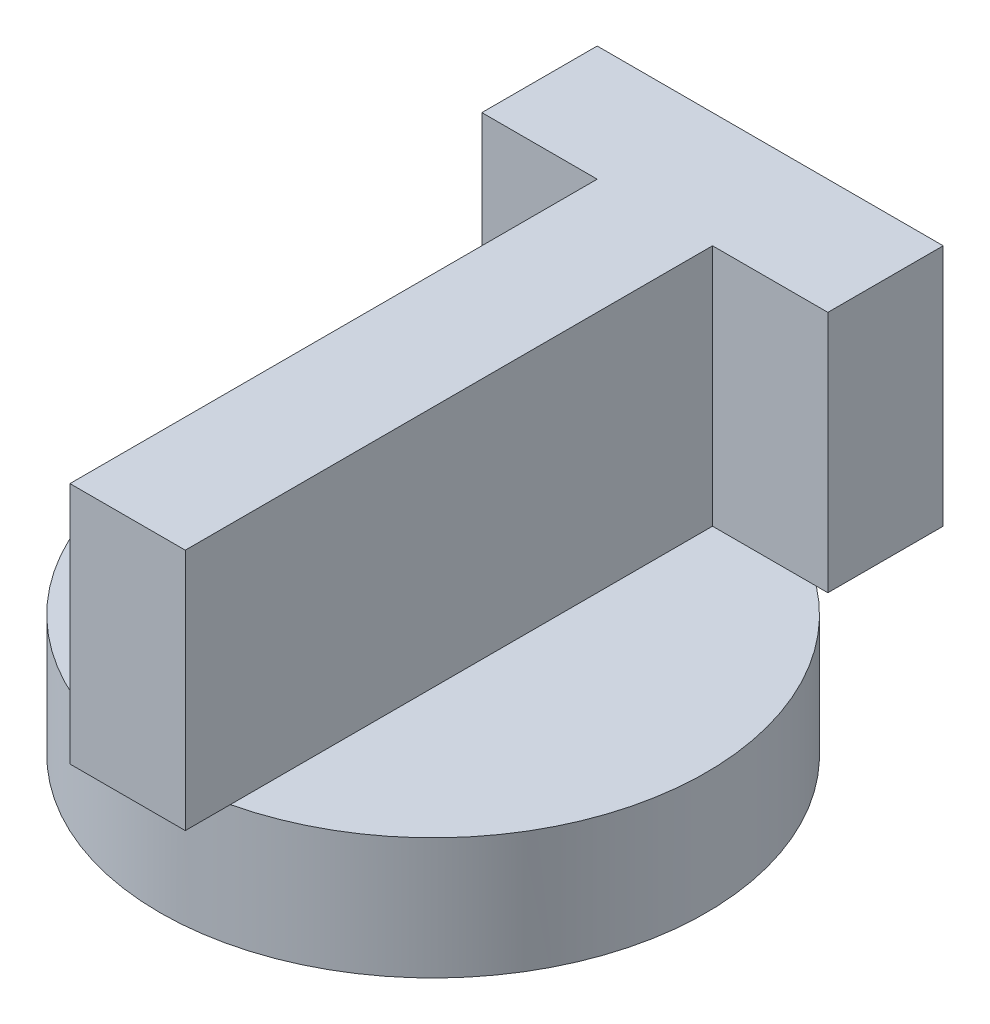
ISO-10303-21;
HEADER;
FILE_DESCRIPTION(('STEP AP214'),'2;1');
FILE_NAME('part.step','',(''),(''),'','','');
FILE_SCHEMA(('AUTOMOTIVE_DESIGN { 1 0 10303 214 1 1 1 1 }'));
ENDSEC;
DATA;
#1=APPLICATION_CONTEXT('core data for automotive mechanical design processes');
#2=APPLICATION_PROTOCOL_DEFINITION('international standard','automotive_design',2000,#1);
#3=PRODUCT_CONTEXT('',#1,'mechanical');
#4=PRODUCT('Part','Part','',(#3));
#5=PRODUCT_RELATED_PRODUCT_CATEGORY('part','',(#4));
#6=PRODUCT_DEFINITION_FORMATION('','',#4);
#7=PRODUCT_DEFINITION_CONTEXT('part definition',#1,'design');
#8=PRODUCT_DEFINITION('design','',#6,#7);
#9=PRODUCT_DEFINITION_SHAPE('','',#8);
#10=(LENGTH_UNIT() NAMED_UNIT(*) SI_UNIT(.MILLI.,.METRE.));
#11=(NAMED_UNIT(*) PLANE_ANGLE_UNIT() SI_UNIT($,.RADIAN.));
#12=(NAMED_UNIT(*) SI_UNIT($,.STERADIAN.) SOLID_ANGLE_UNIT());
#13=UNCERTAINTY_MEASURE_WITH_UNIT(LENGTH_MEASURE(1.E-05),#10,'distance_accuracy_value','');
#14=(GEOMETRIC_REPRESENTATION_CONTEXT(3) GLOBAL_UNCERTAINTY_ASSIGNED_CONTEXT((#13)) GLOBAL_UNIT_ASSIGNED_CONTEXT((#10,
#11,#12)) REPRESENTATION_CONTEXT('',''));
#15=CARTESIAN_POINT('',(0.,0.,0.));
#16=DIRECTION('',(0.,0.,1.));
#17=DIRECTION('',(1.,0.,0.));
#18=AXIS2_PLACEMENT_3D('',#15,#16,#17);
#19=CARTESIAN_POINT('',(0.,10.,0.));
#20=DIRECTION('',(0.,1.,0.));
#21=DIRECTION('',(0.,0.,1.));
#22=AXIS2_PLACEMENT_3D('',#19,#20,#21);
#23=PLANE('',#22);
#24=CARTESIAN_POINT('',(0.,10.,0.));
#25=DIRECTION('',(0.,1.,0.));
#26=DIRECTION('',(0.,0.,1.));
#27=AXIS2_PLACEMENT_3D('',#24,#25,#26);
#28=CIRCLE('',#27,22.5);
#29=CARTESIAN_POINT('',(5.18957559133582,10.,21.8933392880531));
#30=VERTEX_POINT('',#29);
#31=CARTESIAN_POINT('',(13.7379591400478,10.,-17.8190481975435));
#32=VERTEX_POINT('',#31);
#33=EDGE_CURVE('E249',#30,#32,#28,.T.);
#34=ORIENTED_EDGE('',*,*,#33,.T.);
#35=DIRECTION('',(-1.,0.,0.));
#36=VECTOR('',#35,1.);
#37=CARTESIAN_POINT('',(14.6874388391991,10.,-17.8190481975435));
#38=LINE('',#37,#36);
#39=CARTESIAN_POINT('',(5.18957559133582,10.,-17.8190481975435));
#40=VERTEX_POINT('',#39);
#41=EDGE_CURVE('E11',#32,#40,#38,.T.);
#42=ORIENTED_EDGE('',*,*,#41,.T.);
#43=DIRECTION('',(0.,0.,1.));
#44=VECTOR('',#43,1.);
#45=CARTESIAN_POINT('',(5.18957559133582,10.,-17.8190481975435));
#46=LINE('',#45,#44);
#47=EDGE_CURVE('E223',#40,#30,#46,.T.);
#48=ORIENTED_EDGE('',*,*,#47,.T.);
#49=EDGE_LOOP('',(#34,#42,#48));
#50=FACE_BOUND('',#49,.T.);
#51=ADVANCED_FACE('F43',(#50),#23,.T.);
#52=CARTESIAN_POINT('',(-13.7379591400478,10.,-17.8190481975435));
#53=VERTEX_POINT('',#52);
#54=CARTESIAN_POINT('',(-4.30828765652743,10.,22.083674002951));
#55=VERTEX_POINT('',#54);
#56=EDGE_CURVE('E256',#53,#55,#28,.T.);
#57=ORIENTED_EDGE('',*,*,#56,.T.);
#58=DIRECTION('',(0.,0.,-1.));
#59=VECTOR('',#58,1.);
#60=CARTESIAN_POINT('',(-4.30828765652743,10.,25.59975522126));
#61=LINE('',#60,#59);
#62=CARTESIAN_POINT('',(-4.30828765652743,10.,-17.8190481975435));
#63=VERTEX_POINT('',#62);
#64=EDGE_CURVE('E52',#55,#63,#61,.T.);
#65=ORIENTED_EDGE('',*,*,#64,.T.);
#66=DIRECTION('',(-1.,0.,0.));
#67=VECTOR('',#66,1.);
#68=CARTESIAN_POINT('',(-4.30828765652743,10.,-17.8190481975435));
#69=LINE('',#68,#67);
#70=EDGE_CURVE('E191',#63,#53,#69,.T.);
#71=ORIENTED_EDGE('',*,*,#70,.T.);
#72=EDGE_LOOP('',(#57,#65,#71));
#73=FACE_BOUND('',#72,.T.);
#74=ADVANCED_FACE('F279',(#73),#23,.T.);
#75=CARTESIAN_POINT('',(0.,10.,0.));
#76=DIRECTION('',(0.,-1.,0.));
#77=DIRECTION('',(0.,0.,-1.));
#78=AXIS2_PLACEMENT_3D('',#75,#76,#77);
#79=CYLINDRICAL_SURFACE('',#78,22.5);
#80=ORIENTED_EDGE('',*,*,#33,.F.);
#81=EDGE_CURVE('E252',#55,#30,#28,.T.);
#82=ORIENTED_EDGE('',*,*,#81,.F.);
#83=ORIENTED_EDGE('',*,*,#56,.F.);
#84=EDGE_CURVE('E251',#32,#53,#28,.T.);
#85=ORIENTED_EDGE('',*,*,#84,.F.);
#86=EDGE_LOOP('',(#80,#82,#83,#85));
#87=FACE_BOUND('',#86,.T.);
#88=CARTESIAN_POINT('',(0.,0.,0.));
#89=DIRECTION('',(0.,1.,0.));
#90=DIRECTION('',(0.,0.,1.));
#91=AXIS2_PLACEMENT_3D('',#88,#89,#90);
#92=CIRCLE('',#91,22.5);
#93=CARTESIAN_POINT('',(0.,0.,22.5));
#94=VERTEX_POINT('',#93);
#95=EDGE_CURVE('E47',#94,#94,#92,.T.);
#96=ORIENTED_EDGE('',*,*,#95,.T.);
#97=EDGE_LOOP('',(#96));
#98=FACE_BOUND('',#97,.T.);
#99=ADVANCED_FACE('F45',(#87,#98),#79,.T.);
#100=CARTESIAN_POINT('',(0.,0.,0.));
#101=DIRECTION('',(0.,1.,0.));
#102=DIRECTION('',(0.,0.,1.));
#103=AXIS2_PLACEMENT_3D('',#100,#101,#102);
#104=PLANE('',#103);
#105=CARTESIAN_POINT('',(0.,0.,0.));
#106=DIRECTION('',(0.,-1.,0.));
#107=DIRECTION('',(0.,0.,-1.));
#108=AXIS2_PLACEMENT_3D('',#105,#106,#107);
#109=CIRCLE('',#108,21.5);
#110=CARTESIAN_POINT('',(4.83856503950974,0.,20.9484674465326));
#111=VERTEX_POINT('',#110);
#112=CARTESIAN_POINT('',(-4.83856503950294,0.,20.9484674465341));
#113=VERTEX_POINT('',#112);
#114=EDGE_CURVE('E177',#111,#113,#109,.T.);
#115=ORIENTED_EDGE('',*,*,#114,.F.);
#116=DIRECTION('',(-0.471428571428459,0.,0.881904247660097));
#117=VECTOR('',#116,1.);
#118=CARTESIAN_POINT('',(12.4726457883362,0.,6.66734693877418));
#119=LINE('',#118,#117);
#120=CARTESIAN_POINT('',(14.5514200863916,0.,2.77857142856957));
#121=VERTEX_POINT('',#120);
#122=EDGE_CURVE('E61',#121,#111,#119,.T.);
#123=ORIENTED_EDGE('',*,*,#122,.F.);
#124=CARTESIAN_POINT('',(0.,0.,-5.));
#125=DIRECTION('',(0.,-1.,0.));
#126=DIRECTION('',(0.,0.,-1.));
#127=AXIS2_PLACEMENT_3D('',#124,#125,#126);
#128=CIRCLE('',#127,16.5);
#129=CARTESIAN_POINT('',(-14.5514200863896,0.,2.77857142857328));
#130=VERTEX_POINT('',#129);
#131=EDGE_CURVE('E168',#130,#121,#128,.T.);
#132=ORIENTED_EDGE('',*,*,#131,.F.);
#133=DIRECTION('',(-0.471428571428684,0.,-0.881904247659977));
#134=VECTOR('',#133,1.);
#135=CARTESIAN_POINT('',(-12.4726457883335,0.,6.66734693877684));
#136=LINE('',#135,#134);
#137=EDGE_CURVE('E171',#113,#130,#136,.T.);
#138=ORIENTED_EDGE('',*,*,#137,.F.);
#139=EDGE_LOOP('',(#115,#123,#132,#138));
#140=FACE_BOUND('',#139,.T.);
#141=ORIENTED_EDGE('',*,*,#95,.F.);
#142=EDGE_LOOP('',(#141));
#143=FACE_BOUND('',#142,.T.);
#144=ADVANCED_FACE('F265',(#140,#143),#104,.F.);
#145=CARTESIAN_POINT('',(0.,10.,0.));
#146=DIRECTION('',(0.,-1.,0.));
#147=DIRECTION('',(0.,0.,-1.));
#148=AXIS2_PLACEMENT_3D('',#145,#146,#147);
#149=PLANE('',#148);
#150=CARTESIAN_POINT('',(14.6874388391991,10.,-17.8190481975435));
#151=VERTEX_POINT('',#150);
#152=EDGE_CURVE('E54',#151,#32,#38,.T.);
#153=ORIENTED_EDGE('',*,*,#152,.T.);
#154=ORIENTED_EDGE('',*,*,#84,.T.);
#155=CARTESIAN_POINT('',(-13.8061509043907,10.,-17.8190481975435));
#156=VERTEX_POINT('',#155);
#157=EDGE_CURVE('E69',#53,#156,#69,.T.);
#158=ORIENTED_EDGE('',*,*,#157,.T.);
#159=DIRECTION('',(0.,0.,-1.));
#160=VECTOR('',#159,1.);
#161=CARTESIAN_POINT('',(-13.8061509043907,10.,-17.8190481975435));
#162=LINE('',#161,#160);
#163=CARTESIAN_POINT('',(-13.8061509043907,10.,-27.3169114454067));
#164=VERTEX_POINT('',#163);
#165=EDGE_CURVE('E183',#156,#164,#162,.T.);
#166=ORIENTED_EDGE('',*,*,#165,.T.);
#167=DIRECTION('',(1.,0.,0.));
#168=VECTOR('',#167,1.);
#169=CARTESIAN_POINT('',(-13.8061509043907,10.,-27.3169114454067));
#170=LINE('',#169,#168);
#171=CARTESIAN_POINT('',(14.6874388391991,10.,-27.3169114454067));
#172=VERTEX_POINT('',#171);
#173=EDGE_CURVE('E215',#164,#172,#170,.T.);
#174=ORIENTED_EDGE('',*,*,#173,.T.);
#175=DIRECTION('',(0.,0.,1.));
#176=VECTOR('',#175,1.);
#177=CARTESIAN_POINT('',(14.6874388391991,10.,-27.3169114454067));
#178=LINE('',#177,#176);
#179=EDGE_CURVE('E218',#172,#151,#178,.T.);
#180=ORIENTED_EDGE('',*,*,#179,.T.);
#181=EDGE_LOOP('',(#153,#154,#158,#166,#174,#180));
#182=FACE_BOUND('',#181,.T.);
#183=ADVANCED_FACE('F267',(#182),#149,.T.);
#184=CARTESIAN_POINT('',(-13.8061509043907,30.,-17.8190481975435));
#185=DIRECTION('',(-1.,0.,0.));
#186=DIRECTION('',(0.,0.,1.));
#187=AXIS2_PLACEMENT_3D('',#184,#185,#186);
#188=PLANE('',#187);
#189=ORIENTED_EDGE('',*,*,#165,.F.);
#190=DIRECTION('',(0.,-1.,0.));
#191=VECTOR('',#190,1.);
#192=CARTESIAN_POINT('',(-13.8061509043907,30.,-17.8190481975435));
#193=LINE('',#192,#191);
#194=CARTESIAN_POINT('',(-13.8061509043907,30.,-17.8190481975435));
#195=VERTEX_POINT('',#194);
#196=EDGE_CURVE('E234',#195,#156,#193,.T.);
#197=ORIENTED_EDGE('',*,*,#196,.F.);
#198=DIRECTION('',(0.,0.,-1.));
#199=VECTOR('',#198,1.);
#200=CARTESIAN_POINT('',(-13.8061509043907,30.,-17.8190481975435));
#201=LINE('',#200,#199);
#202=CARTESIAN_POINT('',(-13.8061509043907,30.,-27.3169114454067));
#203=VERTEX_POINT('',#202);
#204=EDGE_CURVE('E187',#195,#203,#201,.T.);
#205=ORIENTED_EDGE('',*,*,#204,.T.);
#206=DIRECTION('',(0.,-1.,0.));
#207=VECTOR('',#206,1.);
#208=CARTESIAN_POINT('',(-13.8061509043907,30.,-27.3169114454067));
#209=LINE('',#208,#207);
#210=EDGE_CURVE('E212',#203,#164,#209,.T.);
#211=ORIENTED_EDGE('',*,*,#210,.T.);
#212=EDGE_LOOP('',(#189,#197,#205,#211));
#213=FACE_BOUND('',#212,.T.);
#214=ADVANCED_FACE('F274',(#213),#188,.T.);
#215=CARTESIAN_POINT('',(-4.30828765652743,30.,-17.8190481975435));
#216=DIRECTION('',(0.,0.,1.));
#217=DIRECTION('',(1.,0.,0.));
#218=AXIS2_PLACEMENT_3D('',#215,#216,#217);
#219=PLANE('',#218);
#220=ORIENTED_EDGE('',*,*,#70,.F.);
#221=DIRECTION('',(0.,-1.,0.));
#222=VECTOR('',#221,1.);
#223=CARTESIAN_POINT('',(-4.30828765652743,30.,-17.8190481975435));
#224=LINE('',#223,#222);
#225=CARTESIAN_POINT('',(-4.30828765652743,30.,-17.8190481975435));
#226=VERTEX_POINT('',#225);
#227=EDGE_CURVE('E236',#226,#63,#224,.T.);
#228=ORIENTED_EDGE('',*,*,#227,.F.);
#229=DIRECTION('',(-1.,0.,0.));
#230=VECTOR('',#229,1.);
#231=CARTESIAN_POINT('',(-4.30828765652743,30.,-17.8190481975435));
#232=LINE('',#231,#230);
#233=EDGE_CURVE('E209',#226,#195,#232,.T.);
#234=ORIENTED_EDGE('',*,*,#233,.T.);
#235=ORIENTED_EDGE('',*,*,#196,.T.);
#236=ORIENTED_EDGE('',*,*,#157,.F.);
#237=EDGE_LOOP('',(#220,#228,#234,#235,#236));
#238=FACE_BOUND('',#237,.T.);
#239=ADVANCED_FACE('F290',(#238),#219,.T.);
#240=CARTESIAN_POINT('',(-4.30828765652743,30.,25.59975522126));
#241=DIRECTION('',(-1.,0.,0.));
#242=DIRECTION('',(0.,0.,1.));
#243=AXIS2_PLACEMENT_3D('',#240,#241,#242);
#244=PLANE('',#243);
#245=CARTESIAN_POINT('',(-4.30828765652743,10.,25.59975522126));
#246=VERTEX_POINT('',#245);
#247=EDGE_CURVE('E229',#246,#55,#61,.T.);
#248=ORIENTED_EDGE('',*,*,#247,.F.);
#249=DIRECTION('',(0.,-1.,0.));
#250=VECTOR('',#249,1.);
#251=CARTESIAN_POINT('',(-4.30828765652743,30.,25.59975522126));
#252=LINE('',#251,#250);
#253=CARTESIAN_POINT('',(-4.30828765652743,30.,25.59975522126));
#254=VERTEX_POINT('',#253);
#255=EDGE_CURVE('E238',#254,#246,#252,.T.);
#256=ORIENTED_EDGE('',*,*,#255,.F.);
#257=DIRECTION('',(0.,0.,-1.));
#258=VECTOR('',#257,1.);
#259=CARTESIAN_POINT('',(-4.30828765652743,30.,25.59975522126));
#260=LINE('',#259,#258);
#261=EDGE_CURVE('E206',#254,#226,#260,.T.);
#262=ORIENTED_EDGE('',*,*,#261,.T.);
#263=ORIENTED_EDGE('',*,*,#227,.T.);
#264=ORIENTED_EDGE('',*,*,#64,.F.);
#265=EDGE_LOOP('',(#248,#256,#262,#263,#264));
#266=FACE_BOUND('',#265,.T.);
#267=ADVANCED_FACE('F312',(#266),#244,.T.);
#268=CARTESIAN_POINT('',(5.18957559133582,30.,25.59975522126));
#269=DIRECTION('',(0.,0.,1.));
#270=DIRECTION('',(1.,0.,0.));
#271=AXIS2_PLACEMENT_3D('',#268,#269,#270);
#272=PLANE('',#271);
#273=DIRECTION('',(-1.,0.,0.));
#274=VECTOR('',#273,1.);
#275=CARTESIAN_POINT('',(5.18957559133582,10.,25.59975522126));
#276=LINE('',#275,#274);
#277=CARTESIAN_POINT('',(5.18957559133582,10.,25.59975522126));
#278=VERTEX_POINT('',#277);
#279=EDGE_CURVE('E226',#278,#246,#276,.T.);
#280=ORIENTED_EDGE('',*,*,#279,.F.);
#281=DIRECTION('',(0.,-1.,0.));
#282=VECTOR('',#281,1.);
#283=CARTESIAN_POINT('',(5.18957559133582,30.,25.59975522126));
#284=LINE('',#283,#282);
#285=CARTESIAN_POINT('',(5.18957559133582,30.,25.59975522126));
#286=VERTEX_POINT('',#285);
#287=EDGE_CURVE('E240',#286,#278,#284,.T.);
#288=ORIENTED_EDGE('',*,*,#287,.F.);
#289=DIRECTION('',(-1.,0.,0.));
#290=VECTOR('',#289,1.);
#291=CARTESIAN_POINT('',(5.18957559133582,30.,25.59975522126));
#292=LINE('',#291,#290);
#293=EDGE_CURVE('E203',#286,#254,#292,.T.);
#294=ORIENTED_EDGE('',*,*,#293,.T.);
#295=ORIENTED_EDGE('',*,*,#255,.T.);
#296=EDGE_LOOP('',(#280,#288,#294,#295));
#297=FACE_BOUND('',#296,.T.);
#298=ADVANCED_FACE('F308',(#297),#272,.T.);
#299=CARTESIAN_POINT('',(5.18957559133582,30.,-17.8190481975435));
#300=DIRECTION('',(1.,0.,0.));
#301=DIRECTION('',(0.,0.,-1.));
#302=AXIS2_PLACEMENT_3D('',#299,#300,#301);
#303=PLANE('',#302);
#304=ORIENTED_EDGE('',*,*,#47,.F.);
#305=DIRECTION('',(0.,-1.,0.));
#306=VECTOR('',#305,1.);
#307=CARTESIAN_POINT('',(5.18957559133582,30.,-17.8190481975435));
#308=LINE('',#307,#306);
#309=CARTESIAN_POINT('',(5.18957559133582,30.,-17.8190481975435));
#310=VERTEX_POINT('',#309);
#311=EDGE_CURVE('E243',#310,#40,#308,.T.);
#312=ORIENTED_EDGE('',*,*,#311,.F.);
#313=DIRECTION('',(0.,0.,1.));
#314=VECTOR('',#313,1.);
#315=CARTESIAN_POINT('',(5.18957559133582,30.,-17.8190481975435));
#316=LINE('',#315,#314);
#317=EDGE_CURVE('E200',#310,#286,#316,.T.);
#318=ORIENTED_EDGE('',*,*,#317,.T.);
#319=ORIENTED_EDGE('',*,*,#287,.T.);
#320=EDGE_CURVE('E222',#30,#278,#46,.T.);
#321=ORIENTED_EDGE('',*,*,#320,.F.);
#322=EDGE_LOOP('',(#304,#312,#318,#319,#321));
#323=FACE_BOUND('',#322,.T.);
#324=ADVANCED_FACE('F304',(#323),#303,.T.);
#325=CARTESIAN_POINT('',(14.6874388391991,30.,-17.8190481975435));
#326=DIRECTION('',(0.,0.,1.));
#327=DIRECTION('',(1.,0.,0.));
#328=AXIS2_PLACEMENT_3D('',#325,#326,#327);
#329=PLANE('',#328);
#330=ORIENTED_EDGE('',*,*,#152,.F.);
#331=DIRECTION('',(0.,-1.,0.));
#332=VECTOR('',#331,1.);
#333=CARTESIAN_POINT('',(14.6874388391991,30.,-17.8190481975435));
#334=LINE('',#333,#332);
#335=CARTESIAN_POINT('',(14.6874388391991,30.,-17.8190481975435));
#336=VERTEX_POINT('',#335);
#337=EDGE_CURVE('E245',#336,#151,#334,.T.);
#338=ORIENTED_EDGE('',*,*,#337,.F.);
#339=DIRECTION('',(-1.,0.,0.));
#340=VECTOR('',#339,1.);
#341=CARTESIAN_POINT('',(14.6874388391991,30.,-17.8190481975435));
#342=LINE('',#341,#340);
#343=EDGE_CURVE('E197',#336,#310,#342,.T.);
#344=ORIENTED_EDGE('',*,*,#343,.T.);
#345=ORIENTED_EDGE('',*,*,#311,.T.);
#346=ORIENTED_EDGE('',*,*,#41,.F.);
#347=EDGE_LOOP('',(#330,#338,#344,#345,#346));
#348=FACE_BOUND('',#347,.T.);
#349=ADVANCED_FACE('F300',(#348),#329,.T.);
#350=CARTESIAN_POINT('',(14.6874388391991,30.,-27.3169114454067));
#351=DIRECTION('',(1.,0.,0.));
#352=DIRECTION('',(0.,0.,-1.));
#353=AXIS2_PLACEMENT_3D('',#350,#351,#352);
#354=PLANE('',#353);
#355=ORIENTED_EDGE('',*,*,#179,.F.);
#356=DIRECTION('',(0.,-1.,0.));
#357=VECTOR('',#356,1.);
#358=CARTESIAN_POINT('',(14.6874388391991,30.,-27.3169114454067));
#359=LINE('',#358,#357);
#360=CARTESIAN_POINT('',(14.6874388391991,30.,-27.3169114454067));
#361=VERTEX_POINT('',#360);
#362=EDGE_CURVE('E247',#361,#172,#359,.T.);
#363=ORIENTED_EDGE('',*,*,#362,.F.);
#364=DIRECTION('',(0.,0.,1.));
#365=VECTOR('',#364,1.);
#366=CARTESIAN_POINT('',(14.6874388391991,30.,-27.3169114454067));
#367=LINE('',#366,#365);
#368=EDGE_CURVE('E194',#361,#336,#367,.T.);
#369=ORIENTED_EDGE('',*,*,#368,.T.);
#370=ORIENTED_EDGE('',*,*,#337,.T.);
#371=EDGE_LOOP('',(#355,#363,#369,#370));
#372=FACE_BOUND('',#371,.T.);
#373=ADVANCED_FACE('F296',(#372),#354,.T.);
#374=CARTESIAN_POINT('',(-13.8061509043907,30.,-27.3169114454067));
#375=DIRECTION('',(0.,0.,-1.));
#376=DIRECTION('',(-1.,0.,0.));
#377=AXIS2_PLACEMENT_3D('',#374,#375,#376);
#378=PLANE('',#377);
#379=ORIENTED_EDGE('',*,*,#173,.F.);
#380=ORIENTED_EDGE('',*,*,#210,.F.);
#381=DIRECTION('',(1.,0.,0.));
#382=VECTOR('',#381,1.);
#383=CARTESIAN_POINT('',(-13.8061509043907,30.,-27.3169114454067));
#384=LINE('',#383,#382);
#385=EDGE_CURVE('E190',#203,#361,#384,.T.);
#386=ORIENTED_EDGE('',*,*,#385,.T.);
#387=ORIENTED_EDGE('',*,*,#362,.T.);
#388=EDGE_LOOP('',(#379,#380,#386,#387));
#389=FACE_BOUND('',#388,.T.);
#390=ADVANCED_FACE('F292',(#389),#378,.T.);
#391=CARTESIAN_POINT('',(0.,30.,0.));
#392=DIRECTION('',(0.,-1.,0.));
#393=DIRECTION('',(0.,0.,-1.));
#394=AXIS2_PLACEMENT_3D('',#391,#392,#393);
#395=PLANE('',#394);
#396=ORIENTED_EDGE('',*,*,#204,.F.);
#397=ORIENTED_EDGE('',*,*,#233,.F.);
#398=ORIENTED_EDGE('',*,*,#261,.F.);
#399=ORIENTED_EDGE('',*,*,#293,.F.);
#400=ORIENTED_EDGE('',*,*,#317,.F.);
#401=ORIENTED_EDGE('',*,*,#343,.F.);
#402=ORIENTED_EDGE('',*,*,#368,.F.);
#403=ORIENTED_EDGE('',*,*,#385,.F.);
#404=EDGE_LOOP('',(#396,#397,#398,#399,#400,#401,#402,#403));
#405=FACE_BOUND('',#404,.T.);
#406=ADVANCED_FACE('F295',(#405),#395,.F.);
#407=ORIENTED_EDGE('',*,*,#247,.T.);
#408=ORIENTED_EDGE('',*,*,#81,.T.);
#409=ORIENTED_EDGE('',*,*,#320,.T.);
#410=ORIENTED_EDGE('',*,*,#279,.T.);
#411=EDGE_LOOP('',(#407,#408,#409,#410));
#412=FACE_BOUND('',#411,.T.);
#413=ADVANCED_FACE('F277',(#412),#149,.T.);
#414=CARTESIAN_POINT('',(12.4726457883362,5.,6.66734693877418));
#415=DIRECTION('',(0.881904247660097,0.,0.471428571428459));
#416=DIRECTION('',(0.471428571428459,0.,-0.881904247660097));
#417=AXIS2_PLACEMENT_3D('',#414,#415,#416);
#418=PLANE('',#417);
#419=ORIENTED_EDGE('',*,*,#122,.T.);
#420=DIRECTION('',(0.,-1.,0.));
#421=VECTOR('',#420,1.);
#422=CARTESIAN_POINT('',(4.83856503950974,5.,20.9484674465326));
#423=LINE('',#422,#421);
#424=CARTESIAN_POINT('',(4.83856503950974,5.,20.9484674465326));
#425=VERTEX_POINT('',#424);
#426=EDGE_CURVE('E146',#425,#111,#423,.T.);
#427=ORIENTED_EDGE('',*,*,#426,.F.);
#428=DIRECTION('',(-0.471428571428459,0.,0.881904247660097));
#429=VECTOR('',#428,1.);
#430=CARTESIAN_POINT('',(12.4726457883362,5.,6.66734693877418));
#431=LINE('',#430,#429);
#432=CARTESIAN_POINT('',(14.5514200863916,5.,2.77857142856957));
#433=VERTEX_POINT('',#432);
#434=EDGE_CURVE('E150',#433,#425,#431,.T.);
#435=ORIENTED_EDGE('',*,*,#434,.F.);
#436=DIRECTION('',(0.,-1.,0.));
#437=VECTOR('',#436,1.);
#438=CARTESIAN_POINT('',(14.5514200863916,5.,2.77857142856957));
#439=LINE('',#438,#437);
#440=EDGE_CURVE('E181',#433,#121,#439,.T.);
#441=ORIENTED_EDGE('',*,*,#440,.T.);
#442=EDGE_LOOP('',(#419,#427,#435,#441));
#443=FACE_BOUND('',#442,.T.);
#444=ADVANCED_FACE('F148',(#443),#418,.F.);
#445=CARTESIAN_POINT('',(0.,5.,-5.));
#446=DIRECTION('',(0.,-1.,0.));
#447=DIRECTION('',(0.,0.,-1.));
#448=AXIS2_PLACEMENT_3D('',#445,#446,#447);
#449=CYLINDRICAL_SURFACE('',#448,16.5);
#450=ORIENTED_EDGE('',*,*,#131,.T.);
#451=ORIENTED_EDGE('',*,*,#440,.F.);
#452=CARTESIAN_POINT('',(0.,5.,-5.));
#453=DIRECTION('',(0.,-1.,0.));
#454=DIRECTION('',(0.,0.,-1.));
#455=AXIS2_PLACEMENT_3D('',#452,#453,#454);
#456=CIRCLE('',#455,16.5);
#457=CARTESIAN_POINT('',(-14.5514200863896,5.,2.77857142857328));
#458=VERTEX_POINT('',#457);
#459=EDGE_CURVE('E156',#458,#433,#456,.T.);
#460=ORIENTED_EDGE('',*,*,#459,.F.);
#461=DIRECTION('',(0.,-1.,0.));
#462=VECTOR('',#461,1.);
#463=CARTESIAN_POINT('',(-14.5514200863896,5.,2.77857142857328));
#464=LINE('',#463,#462);
#465=EDGE_CURVE('E184',#458,#130,#464,.T.);
#466=ORIENTED_EDGE('',*,*,#465,.T.);
#467=EDGE_LOOP('',(#450,#451,#460,#466));
#468=FACE_BOUND('',#467,.T.);
#469=ADVANCED_FACE('F323',(#468),#449,.F.);
#470=CARTESIAN_POINT('',(-12.4726457883335,5.,6.66734693877684));
#471=DIRECTION('',(-0.881904247659977,0.,0.471428571428684));
#472=DIRECTION('',(0.471428571428684,0.,0.881904247659977));
#473=AXIS2_PLACEMENT_3D('',#470,#471,#472);
#474=PLANE('',#473);
#475=ORIENTED_EDGE('',*,*,#137,.T.);
#476=ORIENTED_EDGE('',*,*,#465,.F.);
#477=DIRECTION('',(-0.471428571428684,0.,-0.881904247659977));
#478=VECTOR('',#477,1.);
#479=CARTESIAN_POINT('',(-12.4726457883335,5.,6.66734693877684));
#480=LINE('',#479,#478);
#481=CARTESIAN_POINT('',(-4.83856503950294,5.,20.9484674465341));
#482=VERTEX_POINT('',#481);
#483=EDGE_CURVE('E164',#482,#458,#480,.T.);
#484=ORIENTED_EDGE('',*,*,#483,.F.);
#485=DIRECTION('',(0.,-1.,0.));
#486=VECTOR('',#485,1.);
#487=CARTESIAN_POINT('',(-4.83856503950294,5.,20.9484674465341));
#488=LINE('',#487,#486);
#489=EDGE_CURVE('E155',#482,#113,#488,.T.);
#490=ORIENTED_EDGE('',*,*,#489,.T.);
#491=EDGE_LOOP('',(#475,#476,#484,#490));
#492=FACE_BOUND('',#491,.T.);
#493=ADVANCED_FACE('F326',(#492),#474,.F.);
#494=CARTESIAN_POINT('',(0.,5.,0.));
#495=DIRECTION('',(0.,-1.,0.));
#496=DIRECTION('',(0.,0.,-1.));
#497=AXIS2_PLACEMENT_3D('',#494,#495,#496);
#498=CYLINDRICAL_SURFACE('',#497,21.5);
#499=ORIENTED_EDGE('',*,*,#114,.T.);
#500=ORIENTED_EDGE('',*,*,#489,.F.);
#501=CARTESIAN_POINT('',(0.,5.,0.));
#502=DIRECTION('',(0.,-1.,0.));
#503=DIRECTION('',(0.,0.,-1.));
#504=AXIS2_PLACEMENT_3D('',#501,#502,#503);
#505=CIRCLE('',#504,21.5);
#506=EDGE_CURVE('E159',#425,#482,#505,.T.);
#507=ORIENTED_EDGE('',*,*,#506,.F.);
#508=ORIENTED_EDGE('',*,*,#426,.T.);
#509=EDGE_LOOP('',(#499,#500,#507,#508));
#510=FACE_BOUND('',#509,.T.);
#511=ADVANCED_FACE('F160',(#510),#498,.F.);
#512=CARTESIAN_POINT('',(0.,5.,0.));
#513=DIRECTION('',(0.,-1.,0.));
#514=DIRECTION('',(0.,0.,-1.));
#515=AXIS2_PLACEMENT_3D('',#512,#513,#514);
#516=PLANE('',#515);
#517=ORIENTED_EDGE('',*,*,#434,.T.);
#518=ORIENTED_EDGE('',*,*,#506,.T.);
#519=ORIENTED_EDGE('',*,*,#483,.T.);
#520=ORIENTED_EDGE('',*,*,#459,.T.);
#521=EDGE_LOOP('',(#517,#518,#519,#520));
#522=FACE_BOUND('',#521,.T.);
#523=ADVANCED_FACE('F166',(#522),#516,.T.);
#524=CLOSED_SHELL('',(#51,#74,#99,#144,#183,#214,#239,#267,#298,#324,#349,#373,#390,#406,#413,
#444,#469,#493,#511,#523));
#525=MANIFOLD_SOLID_BREP('B2',#524);
#526=ADVANCED_BREP_SHAPE_REPRESENTATION('',(#18,#525),#14);
#527=SHAPE_DEFINITION_REPRESENTATION(#9,#526);
ENDSEC;
END-ISO-10303-21;
